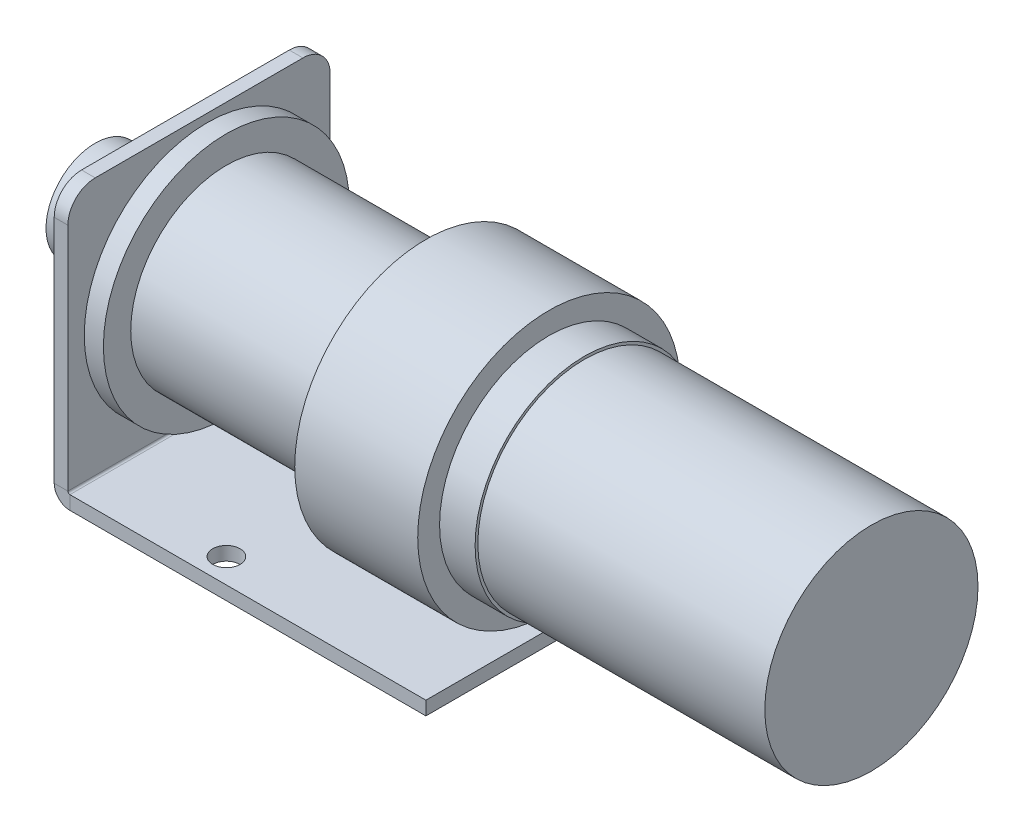
ISO-10303-21;
HEADER;
FILE_DESCRIPTION(('STEP AP214'),'2;1');
FILE_NAME('part.step','',(''),(''),'','','');
FILE_SCHEMA(('AUTOMOTIVE_DESIGN { 1 0 10303 214 1 1 1 1 }'));
ENDSEC;
DATA;
#1=APPLICATION_CONTEXT('core data for automotive mechanical design processes');
#2=APPLICATION_PROTOCOL_DEFINITION('international standard','automotive_design',2000,#1);
#3=PRODUCT_CONTEXT('',#1,'mechanical');
#4=PRODUCT('Part','Part','',(#3));
#5=PRODUCT_RELATED_PRODUCT_CATEGORY('part','',(#4));
#6=PRODUCT_DEFINITION_FORMATION('','',#4);
#7=PRODUCT_DEFINITION_CONTEXT('part definition',#1,'design');
#8=PRODUCT_DEFINITION('design','',#6,#7);
#9=PRODUCT_DEFINITION_SHAPE('','',#8);
#10=(LENGTH_UNIT() NAMED_UNIT(*) SI_UNIT(.MILLI.,.METRE.));
#11=(NAMED_UNIT(*) PLANE_ANGLE_UNIT() SI_UNIT($,.RADIAN.));
#12=(NAMED_UNIT(*) SI_UNIT($,.STERADIAN.) SOLID_ANGLE_UNIT());
#13=UNCERTAINTY_MEASURE_WITH_UNIT(LENGTH_MEASURE(1.E-05),#10,'distance_accuracy_value','');
#14=(GEOMETRIC_REPRESENTATION_CONTEXT(3) GLOBAL_UNCERTAINTY_ASSIGNED_CONTEXT((#13)) GLOBAL_UNIT_ASSIGNED_CONTEXT((#10,
#11,#12)) REPRESENTATION_CONTEXT('',''));
#15=CARTESIAN_POINT('',(0.,0.,0.));
#16=DIRECTION('',(0.,0.,1.));
#17=DIRECTION('',(1.,0.,0.));
#18=AXIS2_PLACEMENT_3D('',#15,#16,#17);
#19=CARTESIAN_POINT('',(-82.2600000000001,-50.,48.));
#20=DIRECTION('',(0.,0.,1.));
#21=DIRECTION('',(1.,0.,0.));
#22=AXIS2_PLACEMENT_3D('',#19,#20,#21);
#23=PLANE('',#22);
#24=DIRECTION('',(0.,-1.,0.));
#25=VECTOR('',#24,1.);
#26=CARTESIAN_POINT('',(-82.2600000000001,-50.,48.));
#27=LINE('',#26,#25);
#28=CARTESIAN_POINT('',(-82.2600000000001,-50.,48.));
#29=VERTEX_POINT('',#28);
#30=CARTESIAN_POINT('',(-82.2600000000001,-55.,48.));
#31=VERTEX_POINT('',#30);
#32=EDGE_CURVE('E130',#29,#31,#27,.T.);
#33=ORIENTED_EDGE('',*,*,#32,.F.);
#34=CARTESIAN_POINT('',(-82.2600000000001,-49.26,48.));
#35=DIRECTION('',(0.,0.,-1.));
#36=DIRECTION('',(-1.,0.,0.));
#37=AXIS2_PLACEMENT_3D('',#34,#35,#36);
#38=CIRCLE('',#37,0.74);
#39=CARTESIAN_POINT('',(-83.0000000000001,-49.26,48.));
#40=VERTEX_POINT('',#39);
#41=EDGE_CURVE('E150',#40,#29,#38,.F.);
#42=ORIENTED_EDGE('',*,*,#41,.F.);
#43=DIRECTION('',(1.,0.,0.));
#44=VECTOR('',#43,1.);
#45=CARTESIAN_POINT('',(-88.0000000000001,-49.26,48.));
#46=LINE('',#45,#44);
#47=CARTESIAN_POINT('',(-88.0000000000001,-49.26,48.));
#48=VERTEX_POINT('',#47);
#49=EDGE_CURVE('E199',#48,#40,#46,.T.);
#50=ORIENTED_EDGE('',*,*,#49,.F.);
#51=CARTESIAN_POINT('',(-82.2600000000001,-49.26,48.));
#52=DIRECTION('',(0.,0.,1.));
#53=DIRECTION('',(1.,0.,0.));
#54=AXIS2_PLACEMENT_3D('',#51,#52,#53);
#55=CIRCLE('',#54,5.74);
#56=EDGE_CURVE('E160',#48,#31,#55,.T.);
#57=ORIENTED_EDGE('',*,*,#56,.T.);
#58=EDGE_LOOP('',(#33,#42,#50,#57));
#59=FACE_BOUND('',#58,.T.);
#60=ADVANCED_FACE('F44',(#59),#23,.T.);
#61=CARTESIAN_POINT('',(-88.0000000000001,-49.26,48.));
#62=DIRECTION('',(0.,0.,1.));
#63=DIRECTION('',(1.,0.,0.));
#64=AXIS2_PLACEMENT_3D('',#61,#62,#63);
#65=PLANE('',#64);
#66=DIRECTION('',(1.,0.,0.));
#67=VECTOR('',#66,1.);
#68=CARTESIAN_POINT('',(-83.0000000000001,-50.,48.));
#69=LINE('',#68,#67);
#70=CARTESIAN_POINT('',(47.9999999999999,-50.,48.));
#71=VERTEX_POINT('',#70);
#72=EDGE_CURVE('E148',#29,#71,#69,.T.);
#73=ORIENTED_EDGE('',*,*,#72,.F.);
#74=ORIENTED_EDGE('',*,*,#32,.T.);
#75=DIRECTION('',(1.,0.,0.));
#76=VECTOR('',#75,1.);
#77=CARTESIAN_POINT('',(-83.0000000000001,-55.,48.));
#78=LINE('',#77,#76);
#79=CARTESIAN_POINT('',(47.9999999999999,-55.,48.));
#80=VERTEX_POINT('',#79);
#81=EDGE_CURVE('E123',#31,#80,#78,.T.);
#82=ORIENTED_EDGE('',*,*,#81,.T.);
#83=DIRECTION('',(0.,-1.,0.));
#84=VECTOR('',#83,1.);
#85=CARTESIAN_POINT('',(47.9999999999999,-50.,48.));
#86=LINE('',#85,#84);
#87=EDGE_CURVE('E128',#71,#80,#86,.T.);
#88=ORIENTED_EDGE('',*,*,#87,.F.);
#89=EDGE_LOOP('',(#73,#74,#82,#88));
#90=FACE_BOUND('',#89,.T.);
#91=ADVANCED_FACE('F126',(#90),#65,.T.);
#92=CARTESIAN_POINT('',(-83.0000000000001,-49.26,-48.));
#93=DIRECTION('',(0.,0.,-1.));
#94=DIRECTION('',(-1.,0.,0.));
#95=AXIS2_PLACEMENT_3D('',#92,#93,#94);
#96=PLANE('',#95);
#97=DIRECTION('',(-1.,0.,0.));
#98=VECTOR('',#97,1.);
#99=CARTESIAN_POINT('',(-83.0000000000001,-49.26,-48.));
#100=LINE('',#99,#98);
#101=CARTESIAN_POINT('',(-83.0000000000001,-49.26,-48.));
#102=VERTEX_POINT('',#101);
#103=CARTESIAN_POINT('',(-88.0000000000001,-49.26,-48.));
#104=VERTEX_POINT('',#103);
#105=EDGE_CURVE('E196',#102,#104,#100,.T.);
#106=ORIENTED_EDGE('',*,*,#105,.F.);
#107=CARTESIAN_POINT('',(-82.2600000000001,-49.26,-48.));
#108=DIRECTION('',(0.,0.,-1.));
#109=DIRECTION('',(-1.,0.,0.));
#110=AXIS2_PLACEMENT_3D('',#107,#108,#109);
#111=CIRCLE('',#110,0.74);
#112=CARTESIAN_POINT('',(-82.2600000000001,-50.,-48.));
#113=VERTEX_POINT('',#112);
#114=EDGE_CURVE('E170',#102,#113,#111,.F.);
#115=ORIENTED_EDGE('',*,*,#114,.T.);
#116=DIRECTION('',(0.,1.,0.));
#117=VECTOR('',#116,1.);
#118=CARTESIAN_POINT('',(-82.2600000000001,-55.,-48.));
#119=LINE('',#118,#117);
#120=CARTESIAN_POINT('',(-82.2600000000001,-55.,-48.));
#121=VERTEX_POINT('',#120);
#122=EDGE_CURVE('E144',#121,#113,#119,.T.);
#123=ORIENTED_EDGE('',*,*,#122,.F.);
#124=CARTESIAN_POINT('',(-82.2600000000001,-49.26,-48.));
#125=DIRECTION('',(0.,0.,1.));
#126=DIRECTION('',(1.,0.,0.));
#127=AXIS2_PLACEMENT_3D('',#124,#125,#126);
#128=CIRCLE('',#127,5.74);
#129=EDGE_CURVE('E134',#104,#121,#128,.T.);
#130=ORIENTED_EDGE('',*,*,#129,.F.);
#131=EDGE_LOOP('',(#106,#115,#123,#130));
#132=FACE_BOUND('',#131,.T.);
#133=ADVANCED_FACE('F244',(#132),#96,.T.);
#134=CARTESIAN_POINT('',(-82.2600000000001,-55.,-48.));
#135=DIRECTION('',(0.,0.,-1.));
#136=DIRECTION('',(-1.,0.,0.));
#137=AXIS2_PLACEMENT_3D('',#134,#135,#136);
#138=PLANE('',#137);
#139=DIRECTION('',(0.,1.,0.));
#140=VECTOR('',#139,1.);
#141=CARTESIAN_POINT('',(-88.0000000000001,45.,-48.));
#142=LINE('',#141,#140);
#143=CARTESIAN_POINT('',(-88.0000000000001,35.,-48.));
#144=VERTEX_POINT('',#143);
#145=EDGE_CURVE('E175',#144,#104,#142,.F.);
#146=ORIENTED_EDGE('',*,*,#145,.F.);
#147=DIRECTION('',(1.,0.,0.));
#148=VECTOR('',#147,1.);
#149=CARTESIAN_POINT('',(-82.2600000000001,35.,-48.));
#150=LINE('',#149,#148);
#151=CARTESIAN_POINT('',(-83.0000000000001,35.,-48.));
#152=VERTEX_POINT('',#151);
#153=EDGE_CURVE('E12',#144,#152,#150,.T.);
#154=ORIENTED_EDGE('',*,*,#153,.T.);
#155=DIRECTION('',(0.,-1.,0.));
#156=VECTOR('',#155,1.);
#157=CARTESIAN_POINT('',(-83.0000000000001,45.,-48.));
#158=LINE('',#157,#156);
#159=EDGE_CURVE('E173',#152,#102,#158,.T.);
#160=ORIENTED_EDGE('',*,*,#159,.T.);
#161=ORIENTED_EDGE('',*,*,#105,.T.);
#162=EDGE_LOOP('',(#146,#154,#160,#161));
#163=FACE_BOUND('',#162,.T.);
#164=ADVANCED_FACE('F247',(#163),#138,.T.);
#165=CARTESIAN_POINT('',(-83.0000000000001,-55.,48.));
#166=DIRECTION('',(0.,1.,0.));
#167=DIRECTION('',(0.,0.,1.));
#168=AXIS2_PLACEMENT_3D('',#165,#166,#167);
#169=PLANE('',#168);
#170=CARTESIAN_POINT('',(-34.0000000000001,-55.,39.));
#171=DIRECTION('',(0.,-1.,0.));
#172=DIRECTION('',(0.,0.,-1.));
#173=AXIS2_PLACEMENT_3D('',#170,#171,#172);
#174=CIRCLE('',#173,5.);
#175=CARTESIAN_POINT('',(-34.0000000000001,-55.,34.));
#176=VERTEX_POINT('',#175);
#177=EDGE_CURVE('E361',#176,#176,#174,.T.);
#178=ORIENTED_EDGE('',*,*,#177,.F.);
#179=EDGE_LOOP('',(#178));
#180=FACE_BOUND('',#179,.T.);
#181=CARTESIAN_POINT('',(-34.0000000000001,-55.,-39.));
#182=DIRECTION('',(0.,-1.,0.));
#183=DIRECTION('',(0.,0.,-1.));
#184=AXIS2_PLACEMENT_3D('',#181,#182,#183);
#185=CIRCLE('',#184,5.);
#186=CARTESIAN_POINT('',(-34.0000000000001,-55.,-44.));
#187=VERTEX_POINT('',#186);
#188=EDGE_CURVE('E366',#187,#187,#185,.T.);
#189=ORIENTED_EDGE('',*,*,#188,.F.);
#190=EDGE_LOOP('',(#189));
#191=FACE_BOUND('',#190,.T.);
#192=DIRECTION('',(1.,0.,0.));
#193=VECTOR('',#192,1.);
#194=CARTESIAN_POINT('',(-83.0000000000001,-55.,-48.));
#195=LINE('',#194,#193);
#196=CARTESIAN_POINT('',(47.9999999999999,-55.,-48.));
#197=VERTEX_POINT('',#196);
#198=EDGE_CURVE('E140',#121,#197,#195,.T.);
#199=ORIENTED_EDGE('',*,*,#198,.T.);
#200=DIRECTION('',(0.,0.,-1.));
#201=VECTOR('',#200,1.);
#202=CARTESIAN_POINT('',(47.9999999999999,-55.,48.));
#203=LINE('',#202,#201);
#204=EDGE_CURVE('E137',#80,#197,#203,.T.);
#205=ORIENTED_EDGE('',*,*,#204,.F.);
#206=ORIENTED_EDGE('',*,*,#81,.F.);
#207=DIRECTION('',(0.,0.,-1.));
#208=VECTOR('',#207,1.);
#209=CARTESIAN_POINT('',(-82.2600000000001,-55.,48.));
#210=LINE('',#209,#208);
#211=EDGE_CURVE('E162',#31,#121,#210,.T.);
#212=ORIENTED_EDGE('',*,*,#211,.T.);
#213=EDGE_LOOP('',(#199,#205,#206,#212));
#214=FACE_BOUND('',#213,.T.);
#215=ADVANCED_FACE('F138',(#180,#191,#214),#169,.F.);
#216=CARTESIAN_POINT('',(47.9999999999999,-50.,48.));
#217=DIRECTION('',(1.,0.,0.));
#218=DIRECTION('',(0.,0.,-1.));
#219=AXIS2_PLACEMENT_3D('',#216,#217,#218);
#220=PLANE('',#219);
#221=DIRECTION('',(0.,-1.,0.));
#222=VECTOR('',#221,1.);
#223=CARTESIAN_POINT('',(47.9999999999999,-50.,-48.));
#224=LINE('',#223,#222);
#225=CARTESIAN_POINT('',(47.9999999999999,-50.,-48.));
#226=VERTEX_POINT('',#225);
#227=EDGE_CURVE('E164',#226,#197,#224,.T.);
#228=ORIENTED_EDGE('',*,*,#227,.F.);
#229=DIRECTION('',(0.,0.,-1.));
#230=VECTOR('',#229,1.);
#231=CARTESIAN_POINT('',(47.9999999999999,-50.,48.));
#232=LINE('',#231,#230);
#233=EDGE_CURVE('E145',#71,#226,#232,.T.);
#234=ORIENTED_EDGE('',*,*,#233,.F.);
#235=ORIENTED_EDGE('',*,*,#87,.T.);
#236=ORIENTED_EDGE('',*,*,#204,.T.);
#237=EDGE_LOOP('',(#228,#234,#235,#236));
#238=FACE_BOUND('',#237,.T.);
#239=ADVANCED_FACE('F147',(#238),#220,.T.);
#240=CARTESIAN_POINT('',(-83.0000000000001,-50.,48.));
#241=DIRECTION('',(0.,1.,0.));
#242=DIRECTION('',(0.,0.,1.));
#243=AXIS2_PLACEMENT_3D('',#240,#241,#242);
#244=PLANE('',#243);
#245=CARTESIAN_POINT('',(-34.0000000000001,-50.,39.));
#246=DIRECTION('',(0.,-1.,0.));
#247=DIRECTION('',(0.,0.,-1.));
#248=AXIS2_PLACEMENT_3D('',#245,#246,#247);
#249=CIRCLE('',#248,5.);
#250=CARTESIAN_POINT('',(-34.0000000000001,-50.,34.));
#251=VERTEX_POINT('',#250);
#252=EDGE_CURVE('E165',#251,#251,#249,.T.);
#253=ORIENTED_EDGE('',*,*,#252,.T.);
#254=EDGE_LOOP('',(#253));
#255=FACE_BOUND('',#254,.T.);
#256=CARTESIAN_POINT('',(-34.0000000000001,-50.,-39.));
#257=DIRECTION('',(0.,-1.,0.));
#258=DIRECTION('',(0.,0.,-1.));
#259=AXIS2_PLACEMENT_3D('',#256,#257,#258);
#260=CIRCLE('',#259,5.);
#261=CARTESIAN_POINT('',(-34.0000000000001,-50.,-44.));
#262=VERTEX_POINT('',#261);
#263=EDGE_CURVE('E362',#262,#262,#260,.T.);
#264=ORIENTED_EDGE('',*,*,#263,.T.);
#265=EDGE_LOOP('',(#264));
#266=FACE_BOUND('',#265,.T.);
#267=DIRECTION('',(1.,0.,0.));
#268=VECTOR('',#267,1.);
#269=CARTESIAN_POINT('',(-83.0000000000001,-50.,-48.));
#270=LINE('',#269,#268);
#271=EDGE_CURVE('E167',#113,#226,#270,.T.);
#272=ORIENTED_EDGE('',*,*,#271,.F.);
#273=DIRECTION('',(0.,0.,-1.));
#274=VECTOR('',#273,1.);
#275=CARTESIAN_POINT('',(-82.2600000000001,-50.,48.));
#276=LINE('',#275,#274);
#277=EDGE_CURVE('E191',#29,#113,#276,.T.);
#278=ORIENTED_EDGE('',*,*,#277,.F.);
#279=ORIENTED_EDGE('',*,*,#72,.T.);
#280=ORIENTED_EDGE('',*,*,#233,.T.);
#281=EDGE_LOOP('',(#272,#278,#279,#280));
#282=FACE_BOUND('',#281,.T.);
#283=ADVANCED_FACE('F240',(#255,#266,#282),#244,.T.);
#284=CARTESIAN_POINT('',(-82.2600000000001,-49.26,48.));
#285=DIRECTION('',(0.,0.,-1.));
#286=DIRECTION('',(-1.,0.,0.));
#287=AXIS2_PLACEMENT_3D('',#284,#285,#286);
#288=CYLINDRICAL_SURFACE('',#287,0.74);
#289=ORIENTED_EDGE('',*,*,#114,.F.);
#290=DIRECTION('',(0.,0.,-1.));
#291=VECTOR('',#290,1.);
#292=CARTESIAN_POINT('',(-83.0000000000001,-49.26,48.));
#293=LINE('',#292,#291);
#294=EDGE_CURVE('E188',#40,#102,#293,.T.);
#295=ORIENTED_EDGE('',*,*,#294,.F.);
#296=ORIENTED_EDGE('',*,*,#41,.T.);
#297=ORIENTED_EDGE('',*,*,#277,.T.);
#298=EDGE_LOOP('',(#289,#295,#296,#297));
#299=FACE_BOUND('',#298,.T.);
#300=ADVANCED_FACE('F233',(#299),#288,.F.);
#301=CARTESIAN_POINT('',(-83.0000000000001,45.,48.));
#302=DIRECTION('',(1.,0.,0.));
#303=DIRECTION('',(0.,0.,-1.));
#304=AXIS2_PLACEMENT_3D('',#301,#302,#303);
#305=PLANE('',#304);
#306=DIRECTION('',(0.,0.,-1.));
#307=VECTOR('',#306,1.);
#308=CARTESIAN_POINT('',(-83.0000000000001,45.,48.));
#309=LINE('',#308,#307);
#310=CARTESIAN_POINT('',(-83.0000000000001,45.,38.));
#311=VERTEX_POINT('',#310);
#312=CARTESIAN_POINT('',(-83.0000000000001,45.,-38.));
#313=VERTEX_POINT('',#312);
#314=EDGE_CURVE('E185',#311,#313,#309,.T.);
#315=ORIENTED_EDGE('',*,*,#314,.F.);
#316=CARTESIAN_POINT('',(-83.0000000000001,35.,38.));
#317=DIRECTION('',(1.,0.,0.));
#318=DIRECTION('',(0.,0.,-1.));
#319=AXIS2_PLACEMENT_3D('',#316,#317,#318);
#320=CIRCLE('',#319,10.);
#321=CARTESIAN_POINT('',(-83.0000000000001,35.,48.));
#322=VERTEX_POINT('',#321);
#323=EDGE_CURVE('E210',#311,#322,#320,.T.);
#324=ORIENTED_EDGE('',*,*,#323,.T.);
#325=DIRECTION('',(0.,-1.,0.));
#326=VECTOR('',#325,1.);
#327=CARTESIAN_POINT('',(-83.0000000000001,45.,48.));
#328=LINE('',#327,#326);
#329=EDGE_CURVE('E156',#322,#40,#328,.T.);
#330=ORIENTED_EDGE('',*,*,#329,.T.);
#331=ORIENTED_EDGE('',*,*,#294,.T.);
#332=ORIENTED_EDGE('',*,*,#159,.F.);
#333=CARTESIAN_POINT('',(-83.0000000000001,35.,-38.));
#334=DIRECTION('',(1.,0.,0.));
#335=DIRECTION('',(0.,0.,-1.));
#336=AXIS2_PLACEMENT_3D('',#333,#334,#335);
#337=CIRCLE('',#336,10.);
#338=EDGE_CURVE('E208',#152,#313,#337,.T.);
#339=ORIENTED_EDGE('',*,*,#338,.T.);
#340=EDGE_LOOP('',(#315,#324,#330,#331,#332,#339));
#341=FACE_BOUND('',#340,.T.);
#342=ADVANCED_FACE('F225',(#341),#305,.T.);
#343=CARTESIAN_POINT('',(-88.0000000000001,45.,48.));
#344=DIRECTION('',(0.,1.,0.));
#345=DIRECTION('',(0.,0.,1.));
#346=AXIS2_PLACEMENT_3D('',#343,#344,#345);
#347=PLANE('',#346);
#348=DIRECTION('',(0.,0.,-1.));
#349=VECTOR('',#348,1.);
#350=CARTESIAN_POINT('',(-88.0000000000001,45.,48.));
#351=LINE('',#350,#349);
#352=CARTESIAN_POINT('',(-88.0000000000001,45.,38.));
#353=VERTEX_POINT('',#352);
#354=CARTESIAN_POINT('',(-88.0000000000001,45.,-38.));
#355=VERTEX_POINT('',#354);
#356=EDGE_CURVE('E183',#353,#355,#351,.T.);
#357=ORIENTED_EDGE('',*,*,#356,.F.);
#358=DIRECTION('',(1.,0.,0.));
#359=VECTOR('',#358,1.);
#360=CARTESIAN_POINT('',(-83.0000000000001,45.,38.));
#361=LINE('',#360,#359);
#362=EDGE_CURVE('E205',#353,#311,#361,.T.);
#363=ORIENTED_EDGE('',*,*,#362,.T.);
#364=ORIENTED_EDGE('',*,*,#314,.T.);
#365=DIRECTION('',(1.,0.,0.));
#366=VECTOR('',#365,1.);
#367=CARTESIAN_POINT('',(-88.0000000000001,45.,-38.));
#368=LINE('',#367,#366);
#369=EDGE_CURVE('E203',#313,#355,#368,.F.);
#370=ORIENTED_EDGE('',*,*,#369,.T.);
#371=EDGE_LOOP('',(#357,#363,#364,#370));
#372=FACE_BOUND('',#371,.T.);
#373=ADVANCED_FACE('F220',(#372),#347,.T.);
#374=CARTESIAN_POINT('',(-88.0000000000001,45.,48.));
#375=DIRECTION('',(1.,0.,0.));
#376=DIRECTION('',(0.,0.,-1.));
#377=AXIS2_PLACEMENT_3D('',#374,#375,#376);
#378=PLANE('',#377);
#379=DIRECTION('',(0.,1.,0.));
#380=VECTOR('',#379,1.);
#381=CARTESIAN_POINT('',(-88.0000000000001,45.,48.));
#382=LINE('',#381,#380);
#383=CARTESIAN_POINT('',(-88.0000000000001,35.,48.));
#384=VERTEX_POINT('',#383);
#385=EDGE_CURVE('E158',#384,#48,#382,.F.);
#386=ORIENTED_EDGE('',*,*,#385,.F.);
#387=CARTESIAN_POINT('',(-88.0000000000001,35.,38.));
#388=DIRECTION('',(1.,0.,0.));
#389=DIRECTION('',(0.,0.,-1.));
#390=AXIS2_PLACEMENT_3D('',#387,#388,#389);
#391=CIRCLE('',#390,10.);
#392=EDGE_CURVE('E52',#384,#353,#391,.F.);
#393=ORIENTED_EDGE('',*,*,#392,.T.);
#394=ORIENTED_EDGE('',*,*,#356,.T.);
#395=CARTESIAN_POINT('',(-88.0000000000001,35.,-38.));
#396=DIRECTION('',(1.,0.,0.));
#397=DIRECTION('',(0.,0.,-1.));
#398=AXIS2_PLACEMENT_3D('',#395,#396,#397);
#399=CIRCLE('',#398,10.);
#400=EDGE_CURVE('E59',#355,#144,#399,.F.);
#401=ORIENTED_EDGE('',*,*,#400,.T.);
#402=ORIENTED_EDGE('',*,*,#145,.T.);
#403=DIRECTION('',(0.,0.,-1.));
#404=VECTOR('',#403,1.);
#405=CARTESIAN_POINT('',(-88.0000000000001,-49.26,48.));
#406=LINE('',#405,#404);
#407=EDGE_CURVE('E180',#48,#104,#406,.T.);
#408=ORIENTED_EDGE('',*,*,#407,.F.);
#409=EDGE_LOOP('',(#386,#393,#394,#401,#402,#408));
#410=FACE_BOUND('',#409,.T.);
#411=ADVANCED_FACE('F215',(#410),#378,.F.);
#412=CARTESIAN_POINT('',(-82.2600000000001,-49.26,48.));
#413=DIRECTION('',(0.,0.,-1.));
#414=DIRECTION('',(-1.,0.,0.));
#415=AXIS2_PLACEMENT_3D('',#412,#413,#414);
#416=CYLINDRICAL_SURFACE('',#415,5.74);
#417=ORIENTED_EDGE('',*,*,#129,.T.);
#418=ORIENTED_EDGE('',*,*,#211,.F.);
#419=ORIENTED_EDGE('',*,*,#56,.F.);
#420=ORIENTED_EDGE('',*,*,#407,.T.);
#421=EDGE_LOOP('',(#417,#418,#419,#420));
#422=FACE_BOUND('',#421,.T.);
#423=ADVANCED_FACE('F250',(#422),#416,.T.);
#424=CARTESIAN_POINT('',(-82.2600000000001,-49.26,48.));
#425=DIRECTION('',(0.,0.,-1.));
#426=DIRECTION('',(-1.,0.,0.));
#427=AXIS2_PLACEMENT_3D('',#424,#425,#426);
#428=PLANE('',#427);
#429=ORIENTED_EDGE('',*,*,#329,.F.);
#430=DIRECTION('',(1.,0.,0.));
#431=VECTOR('',#430,1.);
#432=CARTESIAN_POINT('',(-88.0000000000001,35.,48.));
#433=LINE('',#432,#431);
#434=EDGE_CURVE('E67',#322,#384,#433,.F.);
#435=ORIENTED_EDGE('',*,*,#434,.T.);
#436=ORIENTED_EDGE('',*,*,#385,.T.);
#437=ORIENTED_EDGE('',*,*,#49,.T.);
#438=EDGE_LOOP('',(#429,#435,#436,#437));
#439=FACE_BOUND('',#438,.T.);
#440=ADVANCED_FACE('F226',(#439),#428,.F.);
#441=CARTESIAN_POINT('',(-82.2600000000001,-49.26,-48.));
#442=DIRECTION('',(0.,0.,-1.));
#443=DIRECTION('',(-1.,0.,0.));
#444=AXIS2_PLACEMENT_3D('',#441,#442,#443);
#445=PLANE('',#444);
#446=ORIENTED_EDGE('',*,*,#198,.F.);
#447=ORIENTED_EDGE('',*,*,#122,.T.);
#448=ORIENTED_EDGE('',*,*,#271,.T.);
#449=ORIENTED_EDGE('',*,*,#227,.T.);
#450=EDGE_LOOP('',(#446,#447,#448,#449));
#451=FACE_BOUND('',#450,.T.);
#452=ADVANCED_FACE('F251',(#451),#445,.T.);
#453=CARTESIAN_POINT('',(-88.0000000000001,35.,38.));
#454=DIRECTION('',(-1.,0.,0.));
#455=DIRECTION('',(0.,0.,1.));
#456=AXIS2_PLACEMENT_3D('',#453,#454,#455);
#457=CYLINDRICAL_SURFACE('',#456,10.);
#458=ORIENTED_EDGE('',*,*,#392,.F.);
#459=ORIENTED_EDGE('',*,*,#434,.F.);
#460=ORIENTED_EDGE('',*,*,#323,.F.);
#461=ORIENTED_EDGE('',*,*,#362,.F.);
#462=EDGE_LOOP('',(#458,#459,#460,#461));
#463=FACE_BOUND('',#462,.T.);
#464=ADVANCED_FACE('F223',(#463),#457,.T.);
#465=CARTESIAN_POINT('',(-82.2600000000001,35.,-38.));
#466=DIRECTION('',(1.,0.,0.));
#467=DIRECTION('',(0.,0.,-1.));
#468=AXIS2_PLACEMENT_3D('',#465,#466,#467);
#469=CYLINDRICAL_SURFACE('',#468,10.);
#470=ORIENTED_EDGE('',*,*,#400,.F.);
#471=ORIENTED_EDGE('',*,*,#369,.F.);
#472=ORIENTED_EDGE('',*,*,#338,.F.);
#473=ORIENTED_EDGE('',*,*,#153,.F.);
#474=EDGE_LOOP('',(#470,#471,#472,#473));
#475=FACE_BOUND('',#474,.T.);
#476=ADVANCED_FACE('F46',(#475),#469,.T.);
#477=CARTESIAN_POINT('',(-34.0000000000001,-50.,-39.));
#478=DIRECTION('',(0.,-1.,0.));
#479=DIRECTION('',(0.,0.,-1.));
#480=AXIS2_PLACEMENT_3D('',#477,#478,#479);
#481=CYLINDRICAL_SURFACE('',#480,5.);
#482=ORIENTED_EDGE('',*,*,#263,.F.);
#483=EDGE_LOOP('',(#482));
#484=FACE_BOUND('',#483,.T.);
#485=ORIENTED_EDGE('',*,*,#188,.T.);
#486=EDGE_LOOP('',(#485));
#487=FACE_BOUND('',#486,.T.);
#488=ADVANCED_FACE('F316',(#484,#487),#481,.F.);
#489=CARTESIAN_POINT('',(-34.0000000000001,-50.,39.));
#490=DIRECTION('',(0.,-1.,0.));
#491=DIRECTION('',(0.,0.,-1.));
#492=AXIS2_PLACEMENT_3D('',#489,#490,#491);
#493=CYLINDRICAL_SURFACE('',#492,5.);
#494=ORIENTED_EDGE('',*,*,#252,.F.);
#495=EDGE_LOOP('',(#494));
#496=FACE_BOUND('',#495,.T.);
#497=ORIENTED_EDGE('',*,*,#177,.T.);
#498=EDGE_LOOP('',(#497));
#499=FACE_BOUND('',#498,.T.);
#500=ADVANCED_FACE('F342',(#496,#499),#493,.F.);
#501=CLOSED_SHELL('',(#60,#91,#133,#164,#215,#239,#283,#300,#342,#373,#411,#423,#440,#452,#464,
#476,#488,#500));
#502=MANIFOLD_SOLID_BREP('B2',#501);
#503=CARTESIAN_POINT('',(-121.,0.,0.));
#504=DIRECTION('',(1.,0.,0.));
#505=DIRECTION('',(0.,0.,-1.));
#506=AXIS2_PLACEMENT_3D('',#503,#504,#505);
#507=PLANE('',#506);
#508=CARTESIAN_POINT('',(-121.,0.,0.));
#509=DIRECTION('',(-1.,0.,0.));
#510=DIRECTION('',(0.,0.,1.));
#511=AXIS2_PLACEMENT_3D('',#508,#509,#510);
#512=CIRCLE('',#511,18.);
#513=CARTESIAN_POINT('',(-121.,0.,18.));
#514=VERTEX_POINT('',#513);
#515=EDGE_CURVE('E43',#514,#514,#512,.T.);
#516=ORIENTED_EDGE('',*,*,#515,.T.);
#517=EDGE_LOOP('',(#516));
#518=FACE_BOUND('',#517,.T.);
#519=ADVANCED_FACE('F449',(#518),#507,.F.);
#520=CARTESIAN_POINT('',(-1759.02923371561,0.,0.));
#521=DIRECTION('',(-1.,0.,0.));
#522=DIRECTION('',(0.,0.,1.));
#523=AXIS2_PLACEMENT_3D('',#520,#521,#522);
#524=CYLINDRICAL_SURFACE('',#523,18.);
#525=ORIENTED_EDGE('',*,*,#515,.F.);
#526=EDGE_LOOP('',(#525));
#527=FACE_BOUND('',#526,.T.);
#528=CARTESIAN_POINT('',(-111.,0.,0.));
#529=DIRECTION('',(-1.,0.,0.));
#530=DIRECTION('',(0.,0.,1.));
#531=AXIS2_PLACEMENT_3D('',#528,#529,#530);
#532=CIRCLE('',#531,18.);
#533=CARTESIAN_POINT('',(-111.,0.,18.));
#534=VERTEX_POINT('',#533);
#535=EDGE_CURVE('E455',#534,#534,#532,.T.);
#536=ORIENTED_EDGE('',*,*,#535,.T.);
#537=EDGE_LOOP('',(#536));
#538=FACE_BOUND('',#537,.T.);
#539=ADVANCED_FACE('F511',(#527,#538),#524,.T.);
#540=CARTESIAN_POINT('',(-111.,18.,0.));
#541=DIRECTION('',(-1.,0.,0.));
#542=DIRECTION('',(0.,0.,1.));
#543=AXIS2_PLACEMENT_3D('',#540,#541,#542);
#544=PLANE('',#543);
#545=ORIENTED_EDGE('',*,*,#535,.F.);
#546=EDGE_LOOP('',(#545));
#547=FACE_BOUND('',#546,.T.);
#548=CARTESIAN_POINT('',(-111.,0.,0.));
#549=DIRECTION('',(-1.,0.,0.));
#550=DIRECTION('',(0.,0.,1.));
#551=AXIS2_PLACEMENT_3D('',#548,#549,#550);
#552=CIRCLE('',#551,7.5);
#553=CARTESIAN_POINT('',(-111.,0.,7.5));
#554=VERTEX_POINT('',#553);
#555=EDGE_CURVE('E459',#554,#554,#552,.T.);
#556=ORIENTED_EDGE('',*,*,#555,.T.);
#557=EDGE_LOOP('',(#556));
#558=FACE_BOUND('',#557,.T.);
#559=ADVANCED_FACE('F515',(#547,#558),#544,.F.);
#560=CARTESIAN_POINT('',(-1759.02923371561,0.,0.));
#561=DIRECTION('',(-1.,0.,0.));
#562=DIRECTION('',(0.,0.,1.));
#563=AXIS2_PLACEMENT_3D('',#560,#561,#562);
#564=CYLINDRICAL_SURFACE('',#563,7.5);
#565=ORIENTED_EDGE('',*,*,#555,.F.);
#566=EDGE_LOOP('',(#565));
#567=FACE_BOUND('',#566,.T.);
#568=CARTESIAN_POINT('',(-80.0000000000001,0.,0.));
#569=DIRECTION('',(-1.,0.,0.));
#570=DIRECTION('',(0.,0.,1.));
#571=AXIS2_PLACEMENT_3D('',#568,#569,#570);
#572=CIRCLE('',#571,7.5);
#573=CARTESIAN_POINT('',(-80.0000000000001,0.,7.5));
#574=VERTEX_POINT('',#573);
#575=EDGE_CURVE('E463',#574,#574,#572,.T.);
#576=ORIENTED_EDGE('',*,*,#575,.T.);
#577=EDGE_LOOP('',(#576));
#578=FACE_BOUND('',#577,.T.);
#579=ADVANCED_FACE('F520',(#567,#578),#564,.T.);
#580=CARTESIAN_POINT('',(-80.,7.5,0.));
#581=DIRECTION('',(1.,0.,0.));
#582=DIRECTION('',(0.,0.,-1.));
#583=AXIS2_PLACEMENT_3D('',#580,#581,#582);
#584=PLANE('',#583);
#585=ORIENTED_EDGE('',*,*,#575,.F.);
#586=EDGE_LOOP('',(#585));
#587=FACE_BOUND('',#586,.T.);
#588=CARTESIAN_POINT('',(-80.0000000000001,0.,0.));
#589=DIRECTION('',(-1.,0.,0.));
#590=DIRECTION('',(0.,0.,1.));
#591=AXIS2_PLACEMENT_3D('',#588,#589,#590);
#592=CIRCLE('',#591,45.);
#593=CARTESIAN_POINT('',(-80.0000000000001,0.,45.));
#594=VERTEX_POINT('',#593);
#595=EDGE_CURVE('E468',#594,#594,#592,.T.);
#596=ORIENTED_EDGE('',*,*,#595,.T.);
#597=EDGE_LOOP('',(#596));
#598=FACE_BOUND('',#597,.T.);
#599=ADVANCED_FACE('F526',(#587,#598),#584,.F.);
#600=CARTESIAN_POINT('',(-1759.02923371561,0.,0.));
#601=DIRECTION('',(-1.,0.,0.));
#602=DIRECTION('',(0.,0.,1.));
#603=AXIS2_PLACEMENT_3D('',#600,#601,#602);
#604=CYLINDRICAL_SURFACE('',#603,45.);
#605=ORIENTED_EDGE('',*,*,#595,.F.);
#606=EDGE_LOOP('',(#605));
#607=FACE_BOUND('',#606,.T.);
#608=CARTESIAN_POINT('',(-73.,0.,0.));
#609=DIRECTION('',(-1.,0.,0.));
#610=DIRECTION('',(0.,0.,1.));
#611=AXIS2_PLACEMENT_3D('',#608,#609,#610);
#612=CIRCLE('',#611,45.);
#613=CARTESIAN_POINT('',(-73.,0.,45.));
#614=VERTEX_POINT('',#613);
#615=EDGE_CURVE('E471',#614,#614,#612,.T.);
#616=ORIENTED_EDGE('',*,*,#615,.T.);
#617=EDGE_LOOP('',(#616));
#618=FACE_BOUND('',#617,.T.);
#619=ADVANCED_FACE('F530',(#607,#618),#604,.T.);
#620=CARTESIAN_POINT('',(-73.,45.,0.));
#621=DIRECTION('',(-1.,0.,0.));
#622=DIRECTION('',(0.,0.,1.));
#623=AXIS2_PLACEMENT_3D('',#620,#621,#622);
#624=PLANE('',#623);
#625=ORIENTED_EDGE('',*,*,#615,.F.);
#626=EDGE_LOOP('',(#625));
#627=FACE_BOUND('',#626,.T.);
#628=CARTESIAN_POINT('',(-73.,0.,0.));
#629=DIRECTION('',(-1.,0.,0.));
#630=DIRECTION('',(0.,0.,1.));
#631=AXIS2_PLACEMENT_3D('',#628,#629,#630);
#632=CIRCLE('',#631,35.);
#633=CARTESIAN_POINT('',(-73.,0.,35.));
#634=VERTEX_POINT('',#633);
#635=EDGE_CURVE('E474',#634,#634,#632,.T.);
#636=ORIENTED_EDGE('',*,*,#635,.T.);
#637=EDGE_LOOP('',(#636));
#638=FACE_BOUND('',#637,.T.);
#639=ADVANCED_FACE('F534',(#627,#638),#624,.F.);
#640=CARTESIAN_POINT('',(-1759.02923371561,0.,0.));
#641=DIRECTION('',(-1.,0.,0.));
#642=DIRECTION('',(0.,0.,1.));
#643=AXIS2_PLACEMENT_3D('',#640,#641,#642);
#644=CYLINDRICAL_SURFACE('',#643,35.);
#645=ORIENTED_EDGE('',*,*,#635,.F.);
#646=EDGE_LOOP('',(#645));
#647=FACE_BOUND('',#646,.T.);
#648=CARTESIAN_POINT('',(0.,0.,0.));
#649=DIRECTION('',(-1.,0.,0.));
#650=DIRECTION('',(0.,0.,1.));
#651=AXIS2_PLACEMENT_3D('',#648,#649,#650);
#652=CIRCLE('',#651,35.);
#653=CARTESIAN_POINT('',(0.,0.,35.));
#654=VERTEX_POINT('',#653);
#655=EDGE_CURVE('E477',#654,#654,#652,.T.);
#656=ORIENTED_EDGE('',*,*,#655,.T.);
#657=EDGE_LOOP('',(#656));
#658=FACE_BOUND('',#657,.T.);
#659=ADVANCED_FACE('F538',(#647,#658),#644,.T.);
#660=CARTESIAN_POINT('',(0.,35.,0.));
#661=DIRECTION('',(1.,0.,0.));
#662=DIRECTION('',(0.,0.,-1.));
#663=AXIS2_PLACEMENT_3D('',#660,#661,#662);
#664=PLANE('',#663);
#665=ORIENTED_EDGE('',*,*,#655,.F.);
#666=EDGE_LOOP('',(#665));
#667=FACE_BOUND('',#666,.T.);
#668=CARTESIAN_POINT('',(0.,0.,0.));
#669=DIRECTION('',(-1.,0.,0.));
#670=DIRECTION('',(0.,0.,1.));
#671=AXIS2_PLACEMENT_3D('',#668,#669,#670);
#672=CIRCLE('',#671,48.);
#673=CARTESIAN_POINT('',(0.,0.,48.));
#674=VERTEX_POINT('',#673);
#675=EDGE_CURVE('E480',#674,#674,#672,.T.);
#676=ORIENTED_EDGE('',*,*,#675,.T.);
#677=EDGE_LOOP('',(#676));
#678=FACE_BOUND('',#677,.T.);
#679=ADVANCED_FACE('F542',(#667,#678),#664,.F.);
#680=CARTESIAN_POINT('',(-1759.02923371561,0.,0.));
#681=DIRECTION('',(-1.,0.,0.));
#682=DIRECTION('',(0.,0.,1.));
#683=AXIS2_PLACEMENT_3D('',#680,#681,#682);
#684=CYLINDRICAL_SURFACE('',#683,48.);
#685=ORIENTED_EDGE('',*,*,#675,.F.);
#686=EDGE_LOOP('',(#685));
#687=FACE_BOUND('',#686,.T.);
#688=CARTESIAN_POINT('',(44.9999999999999,0.,0.));
#689=DIRECTION('',(-1.,0.,0.));
#690=DIRECTION('',(0.,0.,1.));
#691=AXIS2_PLACEMENT_3D('',#688,#689,#690);
#692=CIRCLE('',#691,48.);
#693=CARTESIAN_POINT('',(44.9999999999999,0.,48.));
#694=VERTEX_POINT('',#693);
#695=EDGE_CURVE('E483',#694,#694,#692,.T.);
#696=ORIENTED_EDGE('',*,*,#695,.T.);
#697=EDGE_LOOP('',(#696));
#698=FACE_BOUND('',#697,.T.);
#699=ADVANCED_FACE('F546',(#687,#698),#684,.T.);
#700=CARTESIAN_POINT('',(45.,48.,0.));
#701=DIRECTION('',(-1.,0.,0.));
#702=DIRECTION('',(0.,0.,1.));
#703=AXIS2_PLACEMENT_3D('',#700,#701,#702);
#704=PLANE('',#703);
#705=ORIENTED_EDGE('',*,*,#695,.F.);
#706=EDGE_LOOP('',(#705));
#707=FACE_BOUND('',#706,.T.);
#708=CARTESIAN_POINT('',(44.9999999999999,0.,0.));
#709=DIRECTION('',(-1.,0.,0.));
#710=DIRECTION('',(0.,0.,1.));
#711=AXIS2_PLACEMENT_3D('',#708,#709,#710);
#712=CIRCLE('',#711,40.);
#713=CARTESIAN_POINT('',(44.9999999999999,0.,40.));
#714=VERTEX_POINT('',#713);
#715=EDGE_CURVE('E486',#714,#714,#712,.T.);
#716=ORIENTED_EDGE('',*,*,#715,.T.);
#717=EDGE_LOOP('',(#716));
#718=FACE_BOUND('',#717,.T.);
#719=ADVANCED_FACE('F550',(#707,#718),#704,.F.);
#720=CARTESIAN_POINT('',(-1759.02923371561,0.,0.));
#721=DIRECTION('',(-1.,0.,0.));
#722=DIRECTION('',(0.,0.,1.));
#723=AXIS2_PLACEMENT_3D('',#720,#721,#722);
#724=CYLINDRICAL_SURFACE('',#723,40.);
#725=ORIENTED_EDGE('',*,*,#715,.F.);
#726=EDGE_LOOP('',(#725));
#727=FACE_BOUND('',#726,.T.);
#728=CARTESIAN_POINT('',(58.,0.,0.));
#729=DIRECTION('',(-1.,0.,0.));
#730=DIRECTION('',(0.,0.,1.));
#731=AXIS2_PLACEMENT_3D('',#728,#729,#730);
#732=CIRCLE('',#731,40.);
#733=CARTESIAN_POINT('',(58.,0.,40.));
#734=VERTEX_POINT('',#733);
#735=EDGE_CURVE('E489',#734,#734,#732,.T.);
#736=ORIENTED_EDGE('',*,*,#735,.T.);
#737=EDGE_LOOP('',(#736));
#738=FACE_BOUND('',#737,.T.);
#739=ADVANCED_FACE('F554',(#727,#738),#724,.T.);
#740=CARTESIAN_POINT('',(58.,40.,0.));
#741=DIRECTION('',(-1.,0.,0.));
#742=DIRECTION('',(0.,0.,1.));
#743=AXIS2_PLACEMENT_3D('',#740,#741,#742);
#744=PLANE('',#743);
#745=ORIENTED_EDGE('',*,*,#735,.F.);
#746=EDGE_LOOP('',(#745));
#747=FACE_BOUND('',#746,.T.);
#748=CARTESIAN_POINT('',(58.,0.,0.));
#749=DIRECTION('',(-1.,0.,0.));
#750=DIRECTION('',(0.,0.,1.));
#751=AXIS2_PLACEMENT_3D('',#748,#749,#750);
#752=CIRCLE('',#751,39.);
#753=CARTESIAN_POINT('',(58.,0.,39.));
#754=VERTEX_POINT('',#753);
#755=EDGE_CURVE('E492',#754,#754,#752,.T.);
#756=ORIENTED_EDGE('',*,*,#755,.T.);
#757=EDGE_LOOP('',(#756));
#758=FACE_BOUND('',#757,.T.);
#759=ADVANCED_FACE('F507',(#747,#758),#744,.F.);
#760=CARTESIAN_POINT('',(-1759.02923371561,0.,0.));
#761=DIRECTION('',(-1.,0.,0.));
#762=DIRECTION('',(0.,0.,1.));
#763=AXIS2_PLACEMENT_3D('',#760,#761,#762);
#764=CYLINDRICAL_SURFACE('',#763,39.);
#765=ORIENTED_EDGE('',*,*,#755,.F.);
#766=EDGE_LOOP('',(#765));
#767=FACE_BOUND('',#766,.T.);
#768=CARTESIAN_POINT('',(163.,0.,0.));
#769=DIRECTION('',(-1.,0.,0.));
#770=DIRECTION('',(0.,0.,1.));
#771=AXIS2_PLACEMENT_3D('',#768,#769,#770);
#772=CIRCLE('',#771,39.);
#773=CARTESIAN_POINT('',(163.,0.,39.));
#774=VERTEX_POINT('',#773);
#775=EDGE_CURVE('E495',#774,#774,#772,.T.);
#776=ORIENTED_EDGE('',*,*,#775,.T.);
#777=EDGE_LOOP('',(#776));
#778=FACE_BOUND('',#777,.T.);
#779=ADVANCED_FACE('F499',(#767,#778),#764,.T.);
#780=CARTESIAN_POINT('',(163.,39.,0.));
#781=DIRECTION('',(-1.,0.,0.));
#782=DIRECTION('',(0.,0.,1.));
#783=AXIS2_PLACEMENT_3D('',#780,#781,#782);
#784=PLANE('',#783);
#785=ORIENTED_EDGE('',*,*,#775,.F.);
#786=EDGE_LOOP('',(#785));
#787=FACE_BOUND('',#786,.T.);
#788=ADVANCED_FACE('F501',(#787),#784,.F.);
#789=CLOSED_SHELL('',(#519,#539,#559,#579,#599,#619,#639,#659,#679,#699,#719,#739,#759,#779,#788));
#790=MANIFOLD_SOLID_BREP('B6',#789);
#791=ADVANCED_BREP_SHAPE_REPRESENTATION('',(#18,#502,#790),#14);
#792=SHAPE_DEFINITION_REPRESENTATION(#9,#791);
ENDSEC;
END-ISO-10303-21;
